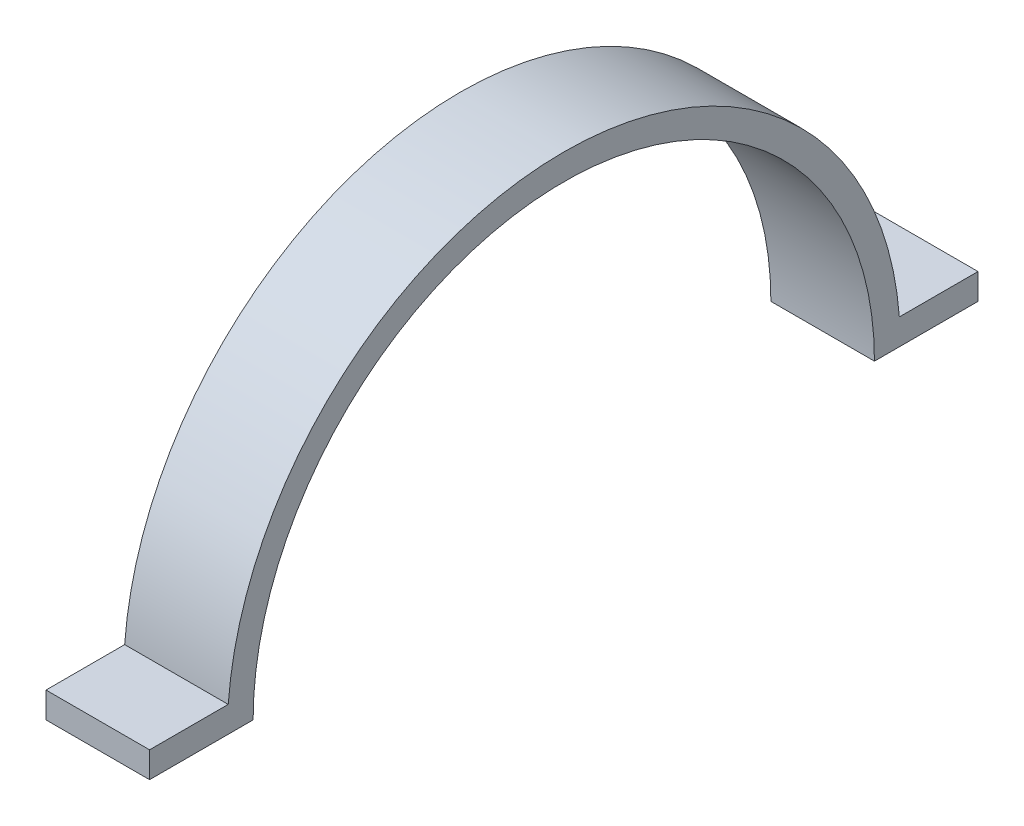
ISO-10303-21;
HEADER;
FILE_DESCRIPTION(('STEP AP214'),'2;1');
FILE_NAME('part.step','',(''),(''),'','','');
FILE_SCHEMA(('AUTOMOTIVE_DESIGN { 1 0 10303 214 1 1 1 1 }'));
ENDSEC;
DATA;
#1=APPLICATION_CONTEXT('core data for automotive mechanical design processes');
#2=APPLICATION_PROTOCOL_DEFINITION('international standard','automotive_design',2000,#1);
#3=PRODUCT_CONTEXT('',#1,'mechanical');
#4=PRODUCT('Part','Part','',(#3));
#5=PRODUCT_RELATED_PRODUCT_CATEGORY('part','',(#4));
#6=PRODUCT_DEFINITION_FORMATION('','',#4);
#7=PRODUCT_DEFINITION_CONTEXT('part definition',#1,'design');
#8=PRODUCT_DEFINITION('design','',#6,#7);
#9=PRODUCT_DEFINITION_SHAPE('','',#8);
#10=(LENGTH_UNIT() NAMED_UNIT(*) SI_UNIT(.MILLI.,.METRE.));
#11=(NAMED_UNIT(*) PLANE_ANGLE_UNIT() SI_UNIT($,.RADIAN.));
#12=(NAMED_UNIT(*) SI_UNIT($,.STERADIAN.) SOLID_ANGLE_UNIT());
#13=UNCERTAINTY_MEASURE_WITH_UNIT(LENGTH_MEASURE(1.E-05),#10,'distance_accuracy_value','');
#14=(GEOMETRIC_REPRESENTATION_CONTEXT(3) GLOBAL_UNCERTAINTY_ASSIGNED_CONTEXT((#13)) GLOBAL_UNIT_ASSIGNED_CONTEXT((#10,
#11,#12)) REPRESENTATION_CONTEXT('',''));
#15=CARTESIAN_POINT('',(0.,0.,0.));
#16=DIRECTION('',(0.,0.,1.));
#17=DIRECTION('',(1.,0.,0.));
#18=AXIS2_PLACEMENT_3D('',#15,#16,#17);
#19=CARTESIAN_POINT('',(10.,0.,0.));
#20=DIRECTION('',(-1.,0.,0.));
#21=DIRECTION('',(0.,0.,1.));
#22=AXIS2_PLACEMENT_3D('',#19,#20,#21);
#23=CYLINDRICAL_SURFACE('',#22,30.);
#24=CARTESIAN_POINT('',(0.,0.,0.));
#25=DIRECTION('',(-1.,0.,0.));
#26=DIRECTION('',(0.,0.,-1.));
#27=AXIS2_PLACEMENT_3D('',#24,#25,#26);
#28=CIRCLE('',#27,30.);
#29=CARTESIAN_POINT('',(0.,0.,30.));
#30=VERTEX_POINT('',#29);
#31=CARTESIAN_POINT('',(0.,0.,-30.));
#32=VERTEX_POINT('',#31);
#33=EDGE_CURVE('E129',#30,#32,#28,.T.);
#34=ORIENTED_EDGE('',*,*,#33,.T.);
#35=DIRECTION('',(-1.,0.,0.));
#36=VECTOR('',#35,1.);
#37=CARTESIAN_POINT('',(10.,0.,-30.));
#38=LINE('',#37,#36);
#39=CARTESIAN_POINT('',(10.,0.,-30.));
#40=VERTEX_POINT('',#39);
#41=EDGE_CURVE('E11',#40,#32,#38,.T.);
#42=ORIENTED_EDGE('',*,*,#41,.F.);
#43=CARTESIAN_POINT('',(10.,0.,0.));
#44=DIRECTION('',(-1.,0.,0.));
#45=DIRECTION('',(0.,0.,-1.));
#46=AXIS2_PLACEMENT_3D('',#43,#44,#45);
#47=CIRCLE('',#46,30.);
#48=CARTESIAN_POINT('',(10.,0.,30.));
#49=VERTEX_POINT('',#48);
#50=EDGE_CURVE('E143',#49,#40,#47,.T.);
#51=ORIENTED_EDGE('',*,*,#50,.F.);
#52=DIRECTION('',(-1.,0.,0.));
#53=VECTOR('',#52,1.);
#54=CARTESIAN_POINT('',(10.,0.,30.));
#55=LINE('',#54,#53);
#56=EDGE_CURVE('E125',#49,#30,#55,.T.);
#57=ORIENTED_EDGE('',*,*,#56,.T.);
#58=EDGE_LOOP('',(#34,#42,#51,#57));
#59=FACE_BOUND('',#58,.T.);
#60=ADVANCED_FACE('F33',(#59),#23,.F.);
#61=CARTESIAN_POINT('',(10.,0.,-30.));
#62=DIRECTION('',(0.,1.,0.));
#63=DIRECTION('',(0.,0.,1.));
#64=AXIS2_PLACEMENT_3D('',#61,#62,#63);
#65=PLANE('',#64);
#66=DIRECTION('',(0.,0.,-1.));
#67=VECTOR('',#66,1.);
#68=CARTESIAN_POINT('',(0.,0.,-30.));
#69=LINE('',#68,#67);
#70=CARTESIAN_POINT('',(0.,0.,-40.));
#71=VERTEX_POINT('',#70);
#72=EDGE_CURVE('E132',#32,#71,#69,.T.);
#73=ORIENTED_EDGE('',*,*,#72,.T.);
#74=DIRECTION('',(-1.,0.,0.));
#75=VECTOR('',#74,1.);
#76=CARTESIAN_POINT('',(10.,0.,-40.));
#77=LINE('',#76,#75);
#78=CARTESIAN_POINT('',(10.,0.,-40.));
#79=VERTEX_POINT('',#78);
#80=EDGE_CURVE('E41',#79,#71,#77,.T.);
#81=ORIENTED_EDGE('',*,*,#80,.F.);
#82=DIRECTION('',(0.,0.,-1.));
#83=VECTOR('',#82,1.);
#84=CARTESIAN_POINT('',(10.,0.,-30.));
#85=LINE('',#84,#83);
#86=EDGE_CURVE('E92',#40,#79,#85,.T.);
#87=ORIENTED_EDGE('',*,*,#86,.F.);
#88=ORIENTED_EDGE('',*,*,#41,.T.);
#89=EDGE_LOOP('',(#73,#81,#87,#88));
#90=FACE_BOUND('',#89,.T.);
#91=ADVANCED_FACE('F178',(#90),#65,.F.);
#92=CARTESIAN_POINT('',(10.,2.5,-40.));
#93=DIRECTION('',(0.,0.,1.));
#94=DIRECTION('',(1.,0.,0.));
#95=AXIS2_PLACEMENT_3D('',#92,#93,#94);
#96=PLANE('',#95);
#97=DIRECTION('',(0.,1.,0.));
#98=VECTOR('',#97,1.);
#99=CARTESIAN_POINT('',(0.,2.5,-40.));
#100=LINE('',#99,#98);
#101=CARTESIAN_POINT('',(0.,2.5,-40.));
#102=VERTEX_POINT('',#101);
#103=EDGE_CURVE('E134',#71,#102,#100,.T.);
#104=ORIENTED_EDGE('',*,*,#103,.T.);
#105=DIRECTION('',(-1.,0.,0.));
#106=VECTOR('',#105,1.);
#107=CARTESIAN_POINT('',(10.,2.5,-40.));
#108=LINE('',#107,#106);
#109=CARTESIAN_POINT('',(10.,2.5,-40.));
#110=VERTEX_POINT('',#109);
#111=EDGE_CURVE('E150',#110,#102,#108,.T.);
#112=ORIENTED_EDGE('',*,*,#111,.F.);
#113=DIRECTION('',(0.,1.,0.));
#114=VECTOR('',#113,1.);
#115=CARTESIAN_POINT('',(10.,2.5,-40.));
#116=LINE('',#115,#114);
#117=EDGE_CURVE('E158',#79,#110,#116,.T.);
#118=ORIENTED_EDGE('',*,*,#117,.F.);
#119=ORIENTED_EDGE('',*,*,#80,.T.);
#120=EDGE_LOOP('',(#104,#112,#118,#119));
#121=FACE_BOUND('',#120,.T.);
#122=ADVANCED_FACE('F156',(#121),#96,.F.);
#123=CARTESIAN_POINT('',(10.,2.5,-32.4037034920393));
#124=DIRECTION('',(0.,-1.,0.));
#125=DIRECTION('',(0.,0.,-1.));
#126=AXIS2_PLACEMENT_3D('',#123,#124,#125);
#127=PLANE('',#126);
#128=DIRECTION('',(0.,0.,1.));
#129=VECTOR('',#128,1.);
#130=CARTESIAN_POINT('',(0.,2.5,-32.4037034920393));
#131=LINE('',#130,#129);
#132=CARTESIAN_POINT('',(0.,2.5,-32.4037034920393));
#133=VERTEX_POINT('',#132);
#134=EDGE_CURVE('E136',#102,#133,#131,.T.);
#135=ORIENTED_EDGE('',*,*,#134,.T.);
#136=DIRECTION('',(-1.,0.,0.));
#137=VECTOR('',#136,1.);
#138=CARTESIAN_POINT('',(10.,2.5,-32.4037034920393));
#139=LINE('',#138,#137);
#140=CARTESIAN_POINT('',(10.,2.5,-32.4037034920393));
#141=VERTEX_POINT('',#140);
#142=EDGE_CURVE('E147',#141,#133,#139,.T.);
#143=ORIENTED_EDGE('',*,*,#142,.F.);
#144=DIRECTION('',(0.,0.,1.));
#145=VECTOR('',#144,1.);
#146=CARTESIAN_POINT('',(10.,2.5,-32.4037034920393));
#147=LINE('',#146,#145);
#148=EDGE_CURVE('E170',#110,#141,#147,.T.);
#149=ORIENTED_EDGE('',*,*,#148,.F.);
#150=ORIENTED_EDGE('',*,*,#111,.T.);
#151=EDGE_LOOP('',(#135,#143,#149,#150));
#152=FACE_BOUND('',#151,.T.);
#153=ADVANCED_FACE('F166',(#152),#127,.F.);
#154=CARTESIAN_POINT('',(10.,0.,0.));
#155=DIRECTION('',(-1.,0.,0.));
#156=DIRECTION('',(0.,0.,1.));
#157=AXIS2_PLACEMENT_3D('',#154,#155,#156);
#158=CYLINDRICAL_SURFACE('',#157,32.5);
#159=CARTESIAN_POINT('',(0.,0.,0.));
#160=DIRECTION('',(1.,0.,0.));
#161=DIRECTION('',(0.,0.,-1.));
#162=AXIS2_PLACEMENT_3D('',#159,#160,#161);
#163=CIRCLE('',#162,32.5);
#164=CARTESIAN_POINT('',(0.,2.50000000000001,32.4037034920393));
#165=VERTEX_POINT('',#164);
#166=EDGE_CURVE('E138',#133,#165,#163,.T.);
#167=ORIENTED_EDGE('',*,*,#166,.T.);
#168=DIRECTION('',(-1.,0.,0.));
#169=VECTOR('',#168,1.);
#170=CARTESIAN_POINT('',(10.,2.50000000000001,32.4037034920393));
#171=LINE('',#170,#169);
#172=CARTESIAN_POINT('',(10.,2.50000000000001,32.4037034920393));
#173=VERTEX_POINT('',#172);
#174=EDGE_CURVE('E120',#173,#165,#171,.T.);
#175=ORIENTED_EDGE('',*,*,#174,.F.);
#176=CARTESIAN_POINT('',(10.,0.,0.));
#177=DIRECTION('',(1.,0.,0.));
#178=DIRECTION('',(0.,0.,-1.));
#179=AXIS2_PLACEMENT_3D('',#176,#177,#178);
#180=CIRCLE('',#179,32.5);
#181=EDGE_CURVE('E111',#141,#173,#180,.T.);
#182=ORIENTED_EDGE('',*,*,#181,.F.);
#183=ORIENTED_EDGE('',*,*,#142,.T.);
#184=EDGE_LOOP('',(#167,#175,#182,#183));
#185=FACE_BOUND('',#184,.T.);
#186=ADVANCED_FACE('F169',(#185),#158,.T.);
#187=CARTESIAN_POINT('',(10.,2.50000000000001,32.4037034920393));
#188=DIRECTION('',(0.,-1.,0.));
#189=DIRECTION('',(0.,0.,-1.));
#190=AXIS2_PLACEMENT_3D('',#187,#188,#189);
#191=PLANE('',#190);
#192=DIRECTION('',(0.,0.,1.));
#193=VECTOR('',#192,1.);
#194=CARTESIAN_POINT('',(0.,2.50000000000001,32.4037034920393));
#195=LINE('',#194,#193);
#196=CARTESIAN_POINT('',(0.,2.50000000000001,40.));
#197=VERTEX_POINT('',#196);
#198=EDGE_CURVE('E119',#165,#197,#195,.T.);
#199=ORIENTED_EDGE('',*,*,#198,.T.);
#200=DIRECTION('',(-1.,0.,0.));
#201=VECTOR('',#200,1.);
#202=CARTESIAN_POINT('',(10.,2.50000000000001,40.));
#203=LINE('',#202,#201);
#204=CARTESIAN_POINT('',(10.,2.50000000000001,40.));
#205=VERTEX_POINT('',#204);
#206=EDGE_CURVE('E116',#205,#197,#203,.T.);
#207=ORIENTED_EDGE('',*,*,#206,.F.);
#208=DIRECTION('',(0.,0.,1.));
#209=VECTOR('',#208,1.);
#210=CARTESIAN_POINT('',(10.,2.50000000000001,32.4037034920393));
#211=LINE('',#210,#209);
#212=EDGE_CURVE('E105',#173,#205,#211,.T.);
#213=ORIENTED_EDGE('',*,*,#212,.F.);
#214=ORIENTED_EDGE('',*,*,#174,.T.);
#215=EDGE_LOOP('',(#199,#207,#213,#214));
#216=FACE_BOUND('',#215,.T.);
#217=ADVANCED_FACE('F117',(#216),#191,.F.);
#218=CARTESIAN_POINT('',(10.,2.50000000000001,40.));
#219=DIRECTION('',(0.,0.,-1.));
#220=DIRECTION('',(-1.,0.,0.));
#221=AXIS2_PLACEMENT_3D('',#218,#219,#220);
#222=PLANE('',#221);
#223=DIRECTION('',(0.,-1.,0.));
#224=VECTOR('',#223,1.);
#225=CARTESIAN_POINT('',(0.,2.50000000000001,40.));
#226=LINE('',#225,#224);
#227=CARTESIAN_POINT('',(0.,0.,40.));
#228=VERTEX_POINT('',#227);
#229=EDGE_CURVE('E78',#197,#228,#226,.T.);
#230=ORIENTED_EDGE('',*,*,#229,.T.);
#231=DIRECTION('',(-1.,0.,0.));
#232=VECTOR('',#231,1.);
#233=CARTESIAN_POINT('',(10.,0.,40.));
#234=LINE('',#233,#232);
#235=CARTESIAN_POINT('',(10.,0.,40.));
#236=VERTEX_POINT('',#235);
#237=EDGE_CURVE('E121',#236,#228,#234,.T.);
#238=ORIENTED_EDGE('',*,*,#237,.F.);
#239=DIRECTION('',(0.,-1.,0.));
#240=VECTOR('',#239,1.);
#241=CARTESIAN_POINT('',(10.,2.50000000000001,40.));
#242=LINE('',#241,#240);
#243=EDGE_CURVE('E109',#205,#236,#242,.T.);
#244=ORIENTED_EDGE('',*,*,#243,.F.);
#245=ORIENTED_EDGE('',*,*,#206,.T.);
#246=EDGE_LOOP('',(#230,#238,#244,#245));
#247=FACE_BOUND('',#246,.T.);
#248=ADVANCED_FACE('F123',(#247),#222,.F.);
#249=CARTESIAN_POINT('',(10.,0.,30.));
#250=DIRECTION('',(0.,1.,0.));
#251=DIRECTION('',(0.,0.,1.));
#252=AXIS2_PLACEMENT_3D('',#249,#250,#251);
#253=PLANE('',#252);
#254=DIRECTION('',(0.,0.,-1.));
#255=VECTOR('',#254,1.);
#256=CARTESIAN_POINT('',(0.,0.,30.));
#257=LINE('',#256,#255);
#258=EDGE_CURVE('E84',#228,#30,#257,.T.);
#259=ORIENTED_EDGE('',*,*,#258,.T.);
#260=ORIENTED_EDGE('',*,*,#56,.F.);
#261=DIRECTION('',(0.,0.,-1.));
#262=VECTOR('',#261,1.);
#263=CARTESIAN_POINT('',(10.,0.,30.));
#264=LINE('',#263,#262);
#265=EDGE_CURVE('E49',#236,#49,#264,.T.);
#266=ORIENTED_EDGE('',*,*,#265,.F.);
#267=ORIENTED_EDGE('',*,*,#237,.T.);
#268=EDGE_LOOP('',(#259,#260,#266,#267));
#269=FACE_BOUND('',#268,.T.);
#270=ADVANCED_FACE('F194',(#269),#253,.F.);
#271=CARTESIAN_POINT('',(10.,0.,0.));
#272=DIRECTION('',(1.,0.,0.));
#273=DIRECTION('',(0.,0.,-1.));
#274=AXIS2_PLACEMENT_3D('',#271,#272,#273);
#275=PLANE('',#274);
#276=ORIENTED_EDGE('',*,*,#50,.T.);
#277=ORIENTED_EDGE('',*,*,#86,.T.);
#278=ORIENTED_EDGE('',*,*,#117,.T.);
#279=ORIENTED_EDGE('',*,*,#148,.T.);
#280=ORIENTED_EDGE('',*,*,#181,.T.);
#281=ORIENTED_EDGE('',*,*,#212,.T.);
#282=ORIENTED_EDGE('',*,*,#243,.T.);
#283=ORIENTED_EDGE('',*,*,#265,.T.);
#284=EDGE_LOOP('',(#276,#277,#278,#279,#280,#281,#282,#283));
#285=FACE_BOUND('',#284,.T.);
#286=ADVANCED_FACE('F107',(#285),#275,.T.);
#287=CARTESIAN_POINT('',(0.,0.,0.));
#288=DIRECTION('',(1.,0.,0.));
#289=DIRECTION('',(0.,0.,-1.));
#290=AXIS2_PLACEMENT_3D('',#287,#288,#289);
#291=PLANE('',#290);
#292=ORIENTED_EDGE('',*,*,#33,.F.);
#293=ORIENTED_EDGE('',*,*,#258,.F.);
#294=ORIENTED_EDGE('',*,*,#229,.F.);
#295=ORIENTED_EDGE('',*,*,#198,.F.);
#296=ORIENTED_EDGE('',*,*,#166,.F.);
#297=ORIENTED_EDGE('',*,*,#134,.F.);
#298=ORIENTED_EDGE('',*,*,#103,.F.);
#299=ORIENTED_EDGE('',*,*,#72,.F.);
#300=EDGE_LOOP('',(#292,#293,#294,#295,#296,#297,#298,#299));
#301=FACE_BOUND('',#300,.T.);
#302=ADVANCED_FACE('F162',(#301),#291,.F.);
#303=CLOSED_SHELL('',(#60,#91,#122,#153,#186,#217,#248,#270,#286,#302));
#304=MANIFOLD_SOLID_BREP('B2',#303);
#305=ADVANCED_BREP_SHAPE_REPRESENTATION('',(#18,#304),#14);
#306=SHAPE_DEFINITION_REPRESENTATION(#9,#305);
ENDSEC;
END-ISO-10303-21;
